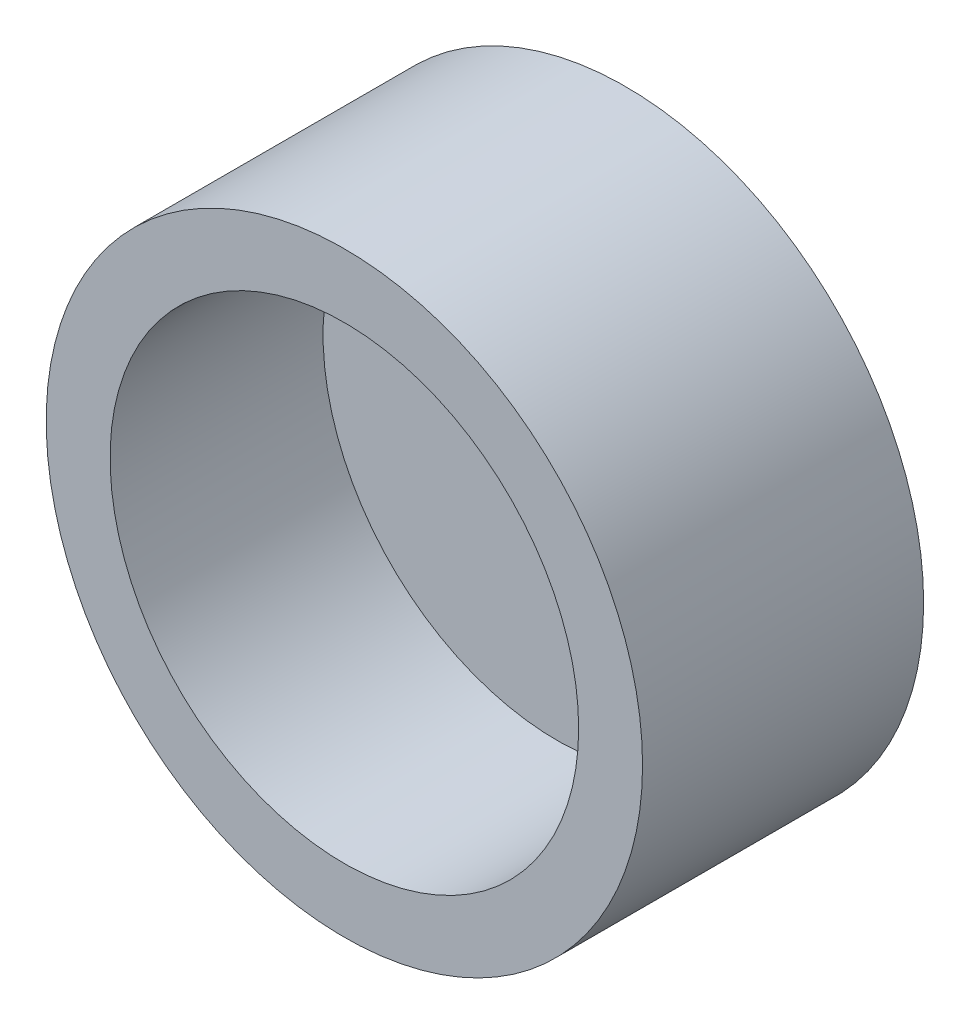
ISO-10303-21;
HEADER;
FILE_DESCRIPTION(('STEP AP214'),'2;1');
FILE_NAME('part.step','',(''),(''),'','','');
FILE_SCHEMA(('AUTOMOTIVE_DESIGN { 1 0 10303 214 1 1 1 1 }'));
ENDSEC;
DATA;
#1=APPLICATION_CONTEXT('core data for automotive mechanical design processes');
#2=APPLICATION_PROTOCOL_DEFINITION('international standard','automotive_design',2000,#1);
#3=PRODUCT_CONTEXT('',#1,'mechanical');
#4=PRODUCT('Part','Part','',(#3));
#5=PRODUCT_RELATED_PRODUCT_CATEGORY('part','',(#4));
#6=PRODUCT_DEFINITION_FORMATION('','',#4);
#7=PRODUCT_DEFINITION_CONTEXT('part definition',#1,'design');
#8=PRODUCT_DEFINITION('design','',#6,#7);
#9=PRODUCT_DEFINITION_SHAPE('','',#8);
#10=(LENGTH_UNIT() NAMED_UNIT(*) SI_UNIT(.MILLI.,.METRE.));
#11=(NAMED_UNIT(*) PLANE_ANGLE_UNIT() SI_UNIT($,.RADIAN.));
#12=(NAMED_UNIT(*) SI_UNIT($,.STERADIAN.) SOLID_ANGLE_UNIT());
#13=UNCERTAINTY_MEASURE_WITH_UNIT(LENGTH_MEASURE(1.E-05),#10,'distance_accuracy_value','');
#14=(GEOMETRIC_REPRESENTATION_CONTEXT(3) GLOBAL_UNCERTAINTY_ASSIGNED_CONTEXT((#13)) GLOBAL_UNIT_ASSIGNED_CONTEXT((#10,
#11,#12)) REPRESENTATION_CONTEXT('',''));
#15=CARTESIAN_POINT('',(0.,0.,0.));
#16=DIRECTION('',(0.,0.,1.));
#17=DIRECTION('',(1.,0.,0.));
#18=AXIS2_PLACEMENT_3D('',#15,#16,#17);
#19=CARTESIAN_POINT('',(0.,0.,-10.));
#20=DIRECTION('',(0.,0.,-1.));
#21=DIRECTION('',(-1.,0.,0.));
#22=AXIS2_PLACEMENT_3D('',#19,#20,#21);
#23=PLANE('',#22);
#24=DIRECTION('',(1.,0.,0.));
#25=VECTOR('',#24,1.);
#26=CARTESIAN_POINT('',(-26.1210678118655,-40.,-10.));
#27=LINE('',#26,#25);
#28=CARTESIAN_POINT('',(-19.05,-40.,-10.));
#29=VERTEX_POINT('',#28);
#30=CARTESIAN_POINT('',(19.05,-40.,-10.));
#31=VERTEX_POINT('',#30);
#32=EDGE_CURVE('E11',#29,#31,#27,.T.);
#33=ORIENTED_EDGE('',*,*,#32,.F.);
#34=DIRECTION('',(0.,1.,0.));
#35=VECTOR('',#34,1.);
#36=CARTESIAN_POINT('',(-19.05,-50.,-10.));
#37=LINE('',#36,#35);
#38=CARTESIAN_POINT('',(-19.05,-35.,-10.));
#39=VERTEX_POINT('',#38);
#40=EDGE_CURVE('E140',#29,#39,#37,.T.);
#41=ORIENTED_EDGE('',*,*,#40,.T.);
#42=DIRECTION('',(1.,0.,0.));
#43=VECTOR('',#42,1.);
#44=CARTESIAN_POINT('',(-19.05,-35.,-10.));
#45=LINE('',#44,#43);
#46=CARTESIAN_POINT('',(19.05,-35.,-10.));
#47=VERTEX_POINT('',#46);
#48=EDGE_CURVE('E149',#39,#47,#45,.T.);
#49=ORIENTED_EDGE('',*,*,#48,.T.);
#50=DIRECTION('',(0.,-1.,0.));
#51=VECTOR('',#50,1.);
#52=CARTESIAN_POINT('',(19.05,-50.,-10.));
#53=LINE('',#52,#51);
#54=EDGE_CURVE('E159',#47,#31,#53,.T.);
#55=ORIENTED_EDGE('',*,*,#54,.T.);
#56=EDGE_LOOP('',(#33,#41,#49,#55));
#57=FACE_BOUND('',#56,.T.);
#58=ADVANCED_FACE('F38',(#57),#23,.T.);
#59=CARTESIAN_POINT('',(0.,0.,-10.));
#60=DIRECTION('',(0.,0.,1.));
#61=DIRECTION('',(1.,0.,0.));
#62=AXIS2_PLACEMENT_3D('',#59,#60,#61);
#63=PLANE('',#62);
#64=DIRECTION('',(0.,1.,0.));
#65=VECTOR('',#64,1.);
#66=CARTESIAN_POINT('',(-19.05,50.,-10.));
#67=LINE('',#66,#65);
#68=CARTESIAN_POINT('',(-19.05,35.,-10.));
#69=VERTEX_POINT('',#68);
#70=CARTESIAN_POINT('',(-19.05,40.,-10.));
#71=VERTEX_POINT('',#70);
#72=EDGE_CURVE('E205',#69,#71,#67,.T.);
#73=ORIENTED_EDGE('',*,*,#72,.T.);
#74=DIRECTION('',(1.,0.,0.));
#75=VECTOR('',#74,1.);
#76=CARTESIAN_POINT('',(-88.9,40.,-10.));
#77=LINE('',#76,#75);
#78=CARTESIAN_POINT('',(19.05,40.,-10.));
#79=VERTEX_POINT('',#78);
#80=EDGE_CURVE('E132',#71,#79,#77,.T.);
#81=ORIENTED_EDGE('',*,*,#80,.T.);
#82=DIRECTION('',(0.,-1.,0.));
#83=VECTOR('',#82,1.);
#84=CARTESIAN_POINT('',(19.05,50.,-10.));
#85=LINE('',#84,#83);
#86=CARTESIAN_POINT('',(19.05,35.,-10.));
#87=VERTEX_POINT('',#86);
#88=EDGE_CURVE('E201',#79,#87,#85,.T.);
#89=ORIENTED_EDGE('',*,*,#88,.T.);
#90=DIRECTION('',(-1.,0.,0.));
#91=VECTOR('',#90,1.);
#92=CARTESIAN_POINT('',(-19.05,35.,-10.));
#93=LINE('',#92,#91);
#94=EDGE_CURVE('E200',#87,#69,#93,.T.);
#95=ORIENTED_EDGE('',*,*,#94,.T.);
#96=EDGE_LOOP('',(#73,#81,#89,#95));
#97=FACE_BOUND('',#96,.T.);
#98=ADVANCED_FACE('F258',(#97),#63,.F.);
#99=CARTESIAN_POINT('',(0.,0.,0.));
#100=DIRECTION('',(0.,0.,1.));
#101=DIRECTION('',(1.,0.,0.));
#102=AXIS2_PLACEMENT_3D('',#99,#100,#101);
#103=PLANE('',#102);
#104=DIRECTION('',(0.,-1.,0.));
#105=VECTOR('',#104,1.);
#106=CARTESIAN_POINT('',(19.05,50.,0.));
#107=LINE('',#106,#105);
#108=CARTESIAN_POINT('',(19.05,50.,0.));
#109=VERTEX_POINT('',#108);
#110=CARTESIAN_POINT('',(19.05,35.,0.));
#111=VERTEX_POINT('',#110);
#112=EDGE_CURVE('E195',#109,#111,#107,.T.);
#113=ORIENTED_EDGE('',*,*,#112,.F.);
#114=DIRECTION('',(1.,0.,0.));
#115=VECTOR('',#114,1.);
#116=CARTESIAN_POINT('',(-19.05,50.,0.));
#117=LINE('',#116,#115);
#118=CARTESIAN_POINT('',(-19.05,50.,0.));
#119=VERTEX_POINT('',#118);
#120=EDGE_CURVE('E224',#119,#109,#117,.T.);
#121=ORIENTED_EDGE('',*,*,#120,.F.);
#122=DIRECTION('',(0.,1.,0.));
#123=VECTOR('',#122,1.);
#124=CARTESIAN_POINT('',(-19.05,50.,0.));
#125=LINE('',#124,#123);
#126=CARTESIAN_POINT('',(-19.05,35.,0.));
#127=VERTEX_POINT('',#126);
#128=EDGE_CURVE('E220',#127,#119,#125,.T.);
#129=ORIENTED_EDGE('',*,*,#128,.F.);
#130=DIRECTION('',(-1.,0.,0.));
#131=VECTOR('',#130,1.);
#132=CARTESIAN_POINT('',(-19.05,35.,0.));
#133=LINE('',#132,#131);
#134=EDGE_CURVE('E216',#111,#127,#133,.T.);
#135=ORIENTED_EDGE('',*,*,#134,.F.);
#136=EDGE_LOOP('',(#113,#121,#129,#135));
#137=FACE_BOUND('',#136,.T.);
#138=CARTESIAN_POINT('',(0.,0.,0.));
#139=DIRECTION('',(0.,0.,1.));
#140=DIRECTION('',(1.,0.,0.));
#141=AXIS2_PLACEMENT_3D('',#138,#139,#140);
#142=CIRCLE('',#141,88.9);
#143=CARTESIAN_POINT('',(88.9,0.,0.));
#144=VERTEX_POINT('',#143);
#145=EDGE_CURVE('E243',#144,#144,#142,.T.);
#146=ORIENTED_EDGE('',*,*,#145,.F.);
#147=EDGE_LOOP('',(#146));
#148=FACE_BOUND('',#147,.T.);
#149=DIRECTION('',(0.,1.,0.));
#150=VECTOR('',#149,1.);
#151=CARTESIAN_POINT('',(-19.05,-50.,0.));
#152=LINE('',#151,#150);
#153=CARTESIAN_POINT('',(-19.05,-50.,0.));
#154=VERTEX_POINT('',#153);
#155=CARTESIAN_POINT('',(-19.05,-35.,0.));
#156=VERTEX_POINT('',#155);
#157=EDGE_CURVE('E166',#154,#156,#152,.T.);
#158=ORIENTED_EDGE('',*,*,#157,.F.);
#159=DIRECTION('',(-1.,0.,0.));
#160=VECTOR('',#159,1.);
#161=CARTESIAN_POINT('',(-19.05,-50.,0.));
#162=LINE('',#161,#160);
#163=CARTESIAN_POINT('',(19.05,-50.,0.));
#164=VERTEX_POINT('',#163);
#165=EDGE_CURVE('E155',#164,#154,#162,.T.);
#166=ORIENTED_EDGE('',*,*,#165,.F.);
#167=DIRECTION('',(0.,-1.,0.));
#168=VECTOR('',#167,1.);
#169=CARTESIAN_POINT('',(19.05,-50.,0.));
#170=LINE('',#169,#168);
#171=CARTESIAN_POINT('',(19.05,-35.,0.));
#172=VERTEX_POINT('',#171);
#173=EDGE_CURVE('E174',#172,#164,#170,.T.);
#174=ORIENTED_EDGE('',*,*,#173,.F.);
#175=DIRECTION('',(1.,0.,0.));
#176=VECTOR('',#175,1.);
#177=CARTESIAN_POINT('',(-19.05,-35.,0.));
#178=LINE('',#177,#176);
#179=EDGE_CURVE('E170',#156,#172,#178,.T.);
#180=ORIENTED_EDGE('',*,*,#179,.F.);
#181=EDGE_LOOP('',(#158,#166,#174,#180));
#182=FACE_BOUND('',#181,.T.);
#183=ADVANCED_FACE('F274',(#137,#148,#182),#103,.F.);
#184=CARTESIAN_POINT('',(0.,0.,83.8));
#185=DIRECTION('',(0.,0.,-1.));
#186=DIRECTION('',(-1.,0.,0.));
#187=AXIS2_PLACEMENT_3D('',#184,#185,#186);
#188=CYLINDRICAL_SURFACE('',#187,88.9);
#189=CARTESIAN_POINT('',(0.,0.,83.8));
#190=DIRECTION('',(0.,0.,1.));
#191=DIRECTION('',(1.,0.,0.));
#192=AXIS2_PLACEMENT_3D('',#189,#190,#191);
#193=CIRCLE('',#192,88.9);
#194=CARTESIAN_POINT('',(88.9,0.,83.8));
#195=VERTEX_POINT('',#194);
#196=EDGE_CURVE('E244',#195,#195,#193,.T.);
#197=ORIENTED_EDGE('',*,*,#196,.F.);
#198=EDGE_LOOP('',(#197));
#199=FACE_BOUND('',#198,.T.);
#200=ORIENTED_EDGE('',*,*,#145,.T.);
#201=EDGE_LOOP('',(#200));
#202=FACE_BOUND('',#201,.T.);
#203=ADVANCED_FACE('F40',(#199,#202),#188,.T.);
#204=CARTESIAN_POINT('',(0.,0.,83.8));
#205=DIRECTION('',(0.,0.,1.));
#206=DIRECTION('',(1.,0.,0.));
#207=AXIS2_PLACEMENT_3D('',#204,#205,#206);
#208=PLANE('',#207);
#209=CARTESIAN_POINT('',(0.,0.,83.8));
#210=DIRECTION('',(0.,0.,1.));
#211=DIRECTION('',(1.,0.,0.));
#212=AXIS2_PLACEMENT_3D('',#209,#210,#211);
#213=CIRCLE('',#212,69.85);
#214=CARTESIAN_POINT('',(69.85,0.,83.8));
#215=VERTEX_POINT('',#214);
#216=EDGE_CURVE('E286',#215,#215,#213,.T.);
#217=ORIENTED_EDGE('',*,*,#216,.F.);
#218=EDGE_LOOP('',(#217));
#219=FACE_BOUND('',#218,.T.);
#220=ORIENTED_EDGE('',*,*,#196,.T.);
#221=EDGE_LOOP('',(#220));
#222=FACE_BOUND('',#221,.T.);
#223=ADVANCED_FACE('F337',(#219,#222),#208,.T.);
#224=CARTESIAN_POINT('',(19.05,50.,-10.));
#225=DIRECTION('',(-1.,0.,0.));
#226=DIRECTION('',(0.,-1.,0.));
#227=AXIS2_PLACEMENT_3D('',#224,#225,#226);
#228=PLANE('',#227);
#229=ORIENTED_EDGE('',*,*,#88,.F.);
#230=CARTESIAN_POINT('',(19.05,42.5,-10.));
#231=DIRECTION('',(1.,0.,0.));
#232=DIRECTION('',(0.,1.,0.));
#233=AXIS2_PLACEMENT_3D('',#230,#231,#232);
#234=CIRCLE('',#233,2.5);
#235=CARTESIAN_POINT('',(19.05,45.,-10.));
#236=VERTEX_POINT('',#235);
#237=EDGE_CURVE('E142',#236,#79,#234,.T.);
#238=ORIENTED_EDGE('',*,*,#237,.F.);
#239=CARTESIAN_POINT('',(19.05,50.,-10.));
#240=VERTEX_POINT('',#239);
#241=EDGE_CURVE('E196',#240,#236,#85,.T.);
#242=ORIENTED_EDGE('',*,*,#241,.F.);
#243=DIRECTION('',(0.,0.,1.));
#244=VECTOR('',#243,1.);
#245=CARTESIAN_POINT('',(19.05,50.,-10.));
#246=LINE('',#245,#244);
#247=EDGE_CURVE('E212',#240,#109,#246,.T.);
#248=ORIENTED_EDGE('',*,*,#247,.T.);
#249=ORIENTED_EDGE('',*,*,#112,.T.);
#250=DIRECTION('',(0.,0.,1.));
#251=VECTOR('',#250,1.);
#252=CARTESIAN_POINT('',(19.05,35.,-10.));
#253=LINE('',#252,#251);
#254=EDGE_CURVE('E239',#87,#111,#253,.T.);
#255=ORIENTED_EDGE('',*,*,#254,.F.);
#256=EDGE_LOOP('',(#229,#238,#242,#248,#249,#255));
#257=FACE_BOUND('',#256,.T.);
#258=ADVANCED_FACE('F264',(#257),#228,.F.);
#259=CARTESIAN_POINT('',(-19.05,35.,-10.));
#260=DIRECTION('',(0.,1.,0.));
#261=DIRECTION('',(-1.,0.,0.));
#262=AXIS2_PLACEMENT_3D('',#259,#260,#261);
#263=PLANE('',#262);
#264=ORIENTED_EDGE('',*,*,#134,.T.);
#265=DIRECTION('',(0.,0.,1.));
#266=VECTOR('',#265,1.);
#267=CARTESIAN_POINT('',(-19.05,35.,-10.));
#268=LINE('',#267,#266);
#269=EDGE_CURVE('E235',#69,#127,#268,.T.);
#270=ORIENTED_EDGE('',*,*,#269,.F.);
#271=ORIENTED_EDGE('',*,*,#94,.F.);
#272=ORIENTED_EDGE('',*,*,#254,.T.);
#273=EDGE_LOOP('',(#264,#270,#271,#272));
#274=FACE_BOUND('',#273,.T.);
#275=ADVANCED_FACE('F331',(#274),#263,.F.);
#276=CARTESIAN_POINT('',(-19.05,50.,-10.));
#277=DIRECTION('',(1.,0.,0.));
#278=DIRECTION('',(0.,1.,0.));
#279=AXIS2_PLACEMENT_3D('',#276,#277,#278);
#280=PLANE('',#279);
#281=CARTESIAN_POINT('',(-19.05,45.,-10.));
#282=VERTEX_POINT('',#281);
#283=CARTESIAN_POINT('',(-19.05,50.,-10.));
#284=VERTEX_POINT('',#283);
#285=EDGE_CURVE('E204',#282,#284,#67,.T.);
#286=ORIENTED_EDGE('',*,*,#285,.F.);
#287=CARTESIAN_POINT('',(-19.05,42.5,-10.));
#288=DIRECTION('',(1.,0.,0.));
#289=DIRECTION('',(0.,1.,0.));
#290=AXIS2_PLACEMENT_3D('',#287,#288,#289);
#291=CIRCLE('',#290,2.5);
#292=EDGE_CURVE('E61',#282,#71,#291,.T.);
#293=ORIENTED_EDGE('',*,*,#292,.T.);
#294=ORIENTED_EDGE('',*,*,#72,.F.);
#295=ORIENTED_EDGE('',*,*,#269,.T.);
#296=ORIENTED_EDGE('',*,*,#128,.T.);
#297=DIRECTION('',(0.,0.,1.));
#298=VECTOR('',#297,1.);
#299=CARTESIAN_POINT('',(-19.05,50.,-10.));
#300=LINE('',#299,#298);
#301=EDGE_CURVE('E231',#284,#119,#300,.T.);
#302=ORIENTED_EDGE('',*,*,#301,.F.);
#303=EDGE_LOOP('',(#286,#293,#294,#295,#296,#302));
#304=FACE_BOUND('',#303,.T.);
#305=ADVANCED_FACE('F293',(#304),#280,.F.);
#306=CARTESIAN_POINT('',(-19.05,50.,-10.));
#307=DIRECTION('',(0.,-1.,0.));
#308=DIRECTION('',(0.,0.,-1.));
#309=AXIS2_PLACEMENT_3D('',#306,#307,#308);
#310=PLANE('',#309);
#311=ORIENTED_EDGE('',*,*,#120,.T.);
#312=ORIENTED_EDGE('',*,*,#247,.F.);
#313=DIRECTION('',(1.,0.,0.));
#314=VECTOR('',#313,1.);
#315=CARTESIAN_POINT('',(-19.05,50.,-10.));
#316=LINE('',#315,#314);
#317=EDGE_CURVE('E209',#284,#240,#316,.T.);
#318=ORIENTED_EDGE('',*,*,#317,.F.);
#319=ORIENTED_EDGE('',*,*,#301,.T.);
#320=EDGE_LOOP('',(#311,#312,#318,#319));
#321=FACE_BOUND('',#320,.T.);
#322=ADVANCED_FACE('F325',(#321),#310,.F.);
#323=ORIENTED_EDGE('',*,*,#241,.T.);
#324=DIRECTION('',(1.,0.,0.));
#325=VECTOR('',#324,1.);
#326=CARTESIAN_POINT('',(-88.9,45.,-10.));
#327=LINE('',#326,#325);
#328=EDGE_CURVE('E248',#236,#282,#327,.F.);
#329=ORIENTED_EDGE('',*,*,#328,.T.);
#330=ORIENTED_EDGE('',*,*,#285,.T.);
#331=ORIENTED_EDGE('',*,*,#317,.T.);
#332=EDGE_LOOP('',(#323,#329,#330,#331));
#333=FACE_BOUND('',#332,.T.);
#334=ADVANCED_FACE('F298',(#333),#63,.F.);
#335=CARTESIAN_POINT('',(-19.05,-50.,-10.));
#336=DIRECTION('',(1.,0.,0.));
#337=DIRECTION('',(0.,0.,-1.));
#338=AXIS2_PLACEMENT_3D('',#335,#336,#337);
#339=PLANE('',#338);
#340=ORIENTED_EDGE('',*,*,#40,.F.);
#341=CARTESIAN_POINT('',(-19.05,-42.5,-10.));
#342=DIRECTION('',(1.,0.,0.));
#343=DIRECTION('',(0.,0.,-1.));
#344=AXIS2_PLACEMENT_3D('',#341,#342,#343);
#345=CIRCLE('',#344,2.5);
#346=CARTESIAN_POINT('',(-19.05,-45.,-10.));
#347=VERTEX_POINT('',#346);
#348=EDGE_CURVE('E126',#347,#29,#345,.F.);
#349=ORIENTED_EDGE('',*,*,#348,.F.);
#350=CARTESIAN_POINT('',(-19.05,-50.,-10.));
#351=VERTEX_POINT('',#350);
#352=EDGE_CURVE('E138',#351,#347,#37,.T.);
#353=ORIENTED_EDGE('',*,*,#352,.F.);
#354=DIRECTION('',(0.,0.,1.));
#355=VECTOR('',#354,1.);
#356=CARTESIAN_POINT('',(-19.05,-50.,-10.));
#357=LINE('',#356,#355);
#358=EDGE_CURVE('E165',#351,#154,#357,.T.);
#359=ORIENTED_EDGE('',*,*,#358,.T.);
#360=ORIENTED_EDGE('',*,*,#157,.T.);
#361=DIRECTION('',(0.,0.,1.));
#362=VECTOR('',#361,1.);
#363=CARTESIAN_POINT('',(-19.05,-35.,-10.));
#364=LINE('',#363,#362);
#365=EDGE_CURVE('E191',#39,#156,#364,.T.);
#366=ORIENTED_EDGE('',*,*,#365,.F.);
#367=EDGE_LOOP('',(#340,#349,#353,#359,#360,#366));
#368=FACE_BOUND('',#367,.T.);
#369=ADVANCED_FACE('F136',(#368),#339,.F.);
#370=CARTESIAN_POINT('',(-19.05,-35.,-10.));
#371=DIRECTION('',(0.,-1.,0.));
#372=DIRECTION('',(1.,0.,0.));
#373=AXIS2_PLACEMENT_3D('',#370,#371,#372);
#374=PLANE('',#373);
#375=ORIENTED_EDGE('',*,*,#179,.T.);
#376=DIRECTION('',(0.,0.,1.));
#377=VECTOR('',#376,1.);
#378=CARTESIAN_POINT('',(19.05,-35.,-10.));
#379=LINE('',#378,#377);
#380=EDGE_CURVE('E187',#47,#172,#379,.T.);
#381=ORIENTED_EDGE('',*,*,#380,.F.);
#382=ORIENTED_EDGE('',*,*,#48,.F.);
#383=ORIENTED_EDGE('',*,*,#365,.T.);
#384=EDGE_LOOP('',(#375,#381,#382,#383));
#385=FACE_BOUND('',#384,.T.);
#386=ADVANCED_FACE('F278',(#385),#374,.F.);
#387=CARTESIAN_POINT('',(19.05,-50.,-10.));
#388=DIRECTION('',(-1.,0.,0.));
#389=DIRECTION('',(0.,0.,1.));
#390=AXIS2_PLACEMENT_3D('',#387,#388,#389);
#391=PLANE('',#390);
#392=CARTESIAN_POINT('',(19.05,-45.,-10.));
#393=VERTEX_POINT('',#392);
#394=CARTESIAN_POINT('',(19.05,-50.,-10.));
#395=VERTEX_POINT('',#394);
#396=EDGE_CURVE('E153',#393,#395,#53,.T.);
#397=ORIENTED_EDGE('',*,*,#396,.F.);
#398=CARTESIAN_POINT('',(19.05,-42.5,-10.));
#399=DIRECTION('',(1.,0.,0.));
#400=DIRECTION('',(0.,0.,-1.));
#401=AXIS2_PLACEMENT_3D('',#398,#399,#400);
#402=CIRCLE('',#401,2.5);
#403=EDGE_CURVE('E53',#31,#393,#402,.T.);
#404=ORIENTED_EDGE('',*,*,#403,.F.);
#405=ORIENTED_EDGE('',*,*,#54,.F.);
#406=ORIENTED_EDGE('',*,*,#380,.T.);
#407=ORIENTED_EDGE('',*,*,#173,.T.);
#408=DIRECTION('',(0.,0.,1.));
#409=VECTOR('',#408,1.);
#410=CARTESIAN_POINT('',(19.05,-50.,-10.));
#411=LINE('',#410,#409);
#412=EDGE_CURVE('E183',#395,#164,#411,.T.);
#413=ORIENTED_EDGE('',*,*,#412,.F.);
#414=EDGE_LOOP('',(#397,#404,#405,#406,#407,#413));
#415=FACE_BOUND('',#414,.T.);
#416=ADVANCED_FACE('F270',(#415),#391,.F.);
#417=CARTESIAN_POINT('',(-19.05,-50.,-10.));
#418=DIRECTION('',(0.,1.,0.));
#419=DIRECTION('',(-1.,0.,0.));
#420=AXIS2_PLACEMENT_3D('',#417,#418,#419);
#421=PLANE('',#420);
#422=ORIENTED_EDGE('',*,*,#165,.T.);
#423=ORIENTED_EDGE('',*,*,#358,.F.);
#424=DIRECTION('',(-1.,0.,0.));
#425=VECTOR('',#424,1.);
#426=CARTESIAN_POINT('',(-19.05,-50.,-10.));
#427=LINE('',#426,#425);
#428=EDGE_CURVE('E146',#395,#351,#427,.T.);
#429=ORIENTED_EDGE('',*,*,#428,.F.);
#430=ORIENTED_EDGE('',*,*,#412,.T.);
#431=EDGE_LOOP('',(#422,#423,#429,#430));
#432=FACE_BOUND('',#431,.T.);
#433=ADVANCED_FACE('F272',(#432),#421,.F.);
#434=DIRECTION('',(1.,0.,0.));
#435=VECTOR('',#434,1.);
#436=CARTESIAN_POINT('',(-26.1210678118655,-45.,-10.));
#437=LINE('',#436,#435);
#438=EDGE_CURVE('E47',#393,#347,#437,.F.);
#439=ORIENTED_EDGE('',*,*,#438,.F.);
#440=ORIENTED_EDGE('',*,*,#396,.T.);
#441=ORIENTED_EDGE('',*,*,#428,.T.);
#442=ORIENTED_EDGE('',*,*,#352,.T.);
#443=EDGE_LOOP('',(#439,#440,#441,#442));
#444=FACE_BOUND('',#443,.T.);
#445=ADVANCED_FACE('F144',(#444),#23,.T.);
#446=CARTESIAN_POINT('',(-88.9,42.5,-10.));
#447=DIRECTION('',(1.,0.,0.));
#448=DIRECTION('',(0.,1.,0.));
#449=AXIS2_PLACEMENT_3D('',#446,#447,#448);
#450=CYLINDRICAL_SURFACE('',#449,2.5);
#451=ORIENTED_EDGE('',*,*,#292,.F.);
#452=ORIENTED_EDGE('',*,*,#328,.F.);
#453=ORIENTED_EDGE('',*,*,#237,.T.);
#454=ORIENTED_EDGE('',*,*,#80,.F.);
#455=EDGE_LOOP('',(#451,#452,#453,#454));
#456=FACE_BOUND('',#455,.T.);
#457=ADVANCED_FACE('F300',(#456),#450,.F.);
#458=CARTESIAN_POINT('',(-26.1210678118655,-42.5,-10.));
#459=DIRECTION('',(1.,0.,0.));
#460=DIRECTION('',(0.,0.,-1.));
#461=AXIS2_PLACEMENT_3D('',#458,#459,#460);
#462=CYLINDRICAL_SURFACE('',#461,2.5);
#463=ORIENTED_EDGE('',*,*,#32,.T.);
#464=ORIENTED_EDGE('',*,*,#403,.T.);
#465=ORIENTED_EDGE('',*,*,#438,.T.);
#466=ORIENTED_EDGE('',*,*,#348,.T.);
#467=EDGE_LOOP('',(#463,#464,#465,#466));
#468=FACE_BOUND('',#467,.T.);
#469=ADVANCED_FACE('F125',(#468),#462,.F.);
#470=CARTESIAN_POINT('',(0.,0.,20.3));
#471=DIRECTION('',(0.,0.,1.));
#472=DIRECTION('',(1.,0.,0.));
#473=AXIS2_PLACEMENT_3D('',#470,#471,#472);
#474=CYLINDRICAL_SURFACE('',#473,69.85);
#475=CARTESIAN_POINT('',(0.,0.,20.3));
#476=DIRECTION('',(0.,0.,1.));
#477=DIRECTION('',(1.,0.,0.));
#478=AXIS2_PLACEMENT_3D('',#475,#476,#477);
#479=CIRCLE('',#478,69.85);
#480=CARTESIAN_POINT('',(69.85,0.,20.3));
#481=VERTEX_POINT('',#480);
#482=EDGE_CURVE('E282',#481,#481,#479,.T.);
#483=ORIENTED_EDGE('',*,*,#482,.F.);
#484=EDGE_LOOP('',(#483));
#485=FACE_BOUND('',#484,.T.);
#486=ORIENTED_EDGE('',*,*,#216,.T.);
#487=EDGE_LOOP('',(#486));
#488=FACE_BOUND('',#487,.T.);
#489=ADVANCED_FACE('F307',(#485,#488),#474,.F.);
#490=CARTESIAN_POINT('',(0.,0.,20.3));
#491=DIRECTION('',(0.,0.,1.));
#492=DIRECTION('',(1.,0.,0.));
#493=AXIS2_PLACEMENT_3D('',#490,#491,#492);
#494=PLANE('',#493);
#495=ORIENTED_EDGE('',*,*,#482,.T.);
#496=EDGE_LOOP('',(#495));
#497=FACE_BOUND('',#496,.T.);
#498=ADVANCED_FACE('F416',(#497),#494,.T.);
#499=CLOSED_SHELL('',(#58,#98,#183,#203,#223,#258,#275,#305,#322,#334,#369,#386,#416,#433,#445,
#457,#469,#489,#498));
#500=MANIFOLD_SOLID_BREP('B2',#499);
#501=ADVANCED_BREP_SHAPE_REPRESENTATION('',(#18,#500),#14);
#502=SHAPE_DEFINITION_REPRESENTATION(#9,#501);
ENDSEC;
END-ISO-10303-21;
